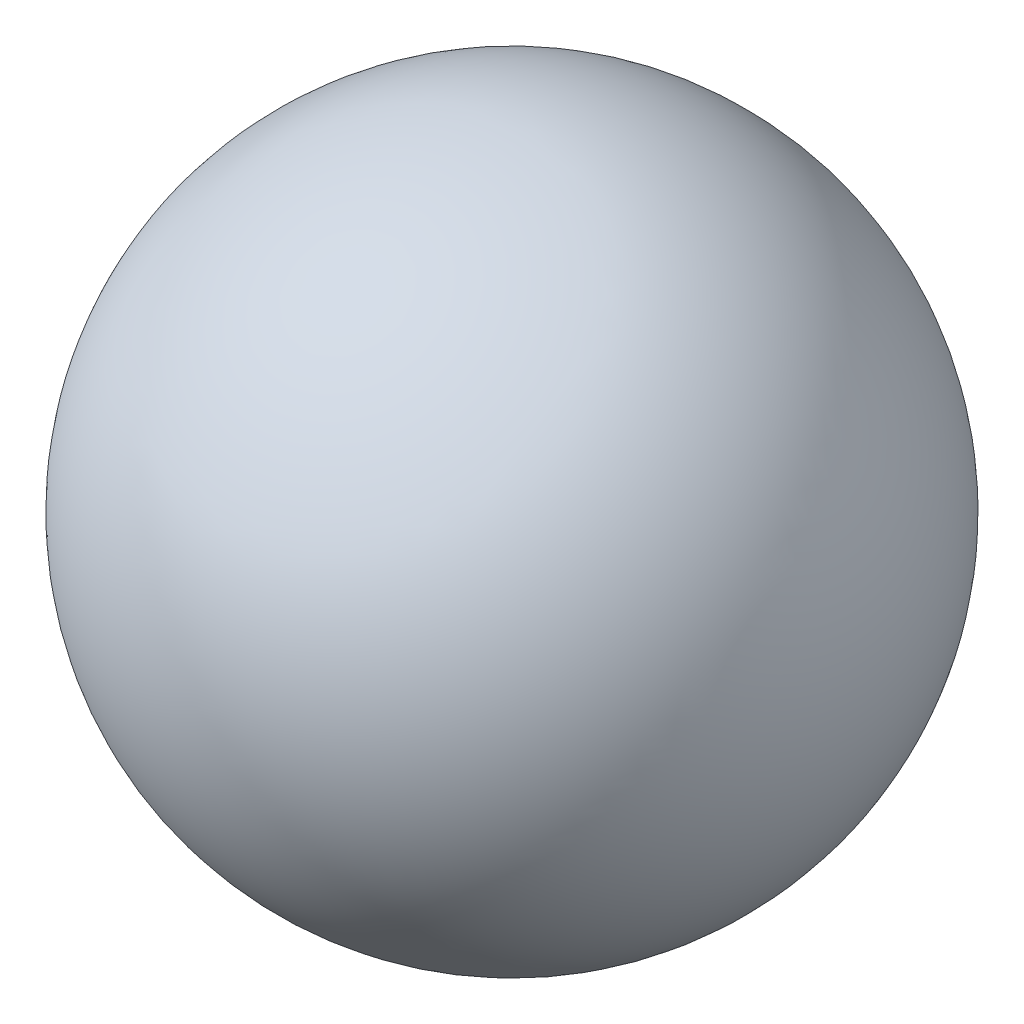
ISO-10303-21;
HEADER;
FILE_DESCRIPTION(('STEP AP214'),'2;1');
FILE_NAME('part.step','',(''),(''),'','','');
FILE_SCHEMA(('AUTOMOTIVE_DESIGN { 1 0 10303 214 1 1 1 1 }'));
ENDSEC;
DATA;
#1=APPLICATION_CONTEXT('core data for automotive mechanical design processes');
#2=APPLICATION_PROTOCOL_DEFINITION('international standard','automotive_design',2000,#1);
#3=PRODUCT_CONTEXT('',#1,'mechanical');
#4=PRODUCT('Part','Part','',(#3));
#5=PRODUCT_RELATED_PRODUCT_CATEGORY('part','',(#4));
#6=PRODUCT_DEFINITION_FORMATION('','',#4);
#7=PRODUCT_DEFINITION_CONTEXT('part definition',#1,'design');
#8=PRODUCT_DEFINITION('design','',#6,#7);
#9=PRODUCT_DEFINITION_SHAPE('','',#8);
#10=(LENGTH_UNIT() NAMED_UNIT(*) SI_UNIT(.MILLI.,.METRE.));
#11=(NAMED_UNIT(*) PLANE_ANGLE_UNIT() SI_UNIT($,.RADIAN.));
#12=(NAMED_UNIT(*) SI_UNIT($,.STERADIAN.) SOLID_ANGLE_UNIT());
#13=UNCERTAINTY_MEASURE_WITH_UNIT(LENGTH_MEASURE(1.E-05),#10,'distance_accuracy_value','');
#14=(GEOMETRIC_REPRESENTATION_CONTEXT(3) GLOBAL_UNCERTAINTY_ASSIGNED_CONTEXT((#13)) GLOBAL_UNIT_ASSIGNED_CONTEXT((#10,
#11,#12)) REPRESENTATION_CONTEXT('',''));
#15=CARTESIAN_POINT('',(0.,0.,0.));
#16=DIRECTION('',(0.,0.,1.));
#17=DIRECTION('',(1.,0.,0.));
#18=AXIS2_PLACEMENT_3D('',#15,#16,#17);
#19=CARTESIAN_POINT('',(0.,0.,0.));
#20=DIRECTION('',(-1.,0.,0.));
#21=DIRECTION('',(0.,1.,0.));
#22=AXIS2_PLACEMENT_3D('',#19,#20,#21);
#23=SPHERICAL_SURFACE('',#22,0.220000000000001);
#24=CARTESIAN_POINT('',(-0.220000000000001,0.,0.));
#25=VERTEX_POINT('',#24);
#26=VERTEX_LOOP('',#25);
#27=FACE_BOUND('',#26,.T.);
#28=ADVANCED_FACE('F33',(#27),#23,.T.);
#29=CLOSED_SHELL('',(#28));
#30=MANIFOLD_SOLID_BREP('B2',#29);
#31=ADVANCED_BREP_SHAPE_REPRESENTATION('',(#18,#30),#14);
#32=SHAPE_DEFINITION_REPRESENTATION(#9,#31);
ENDSEC;
END-ISO-10303-21;
